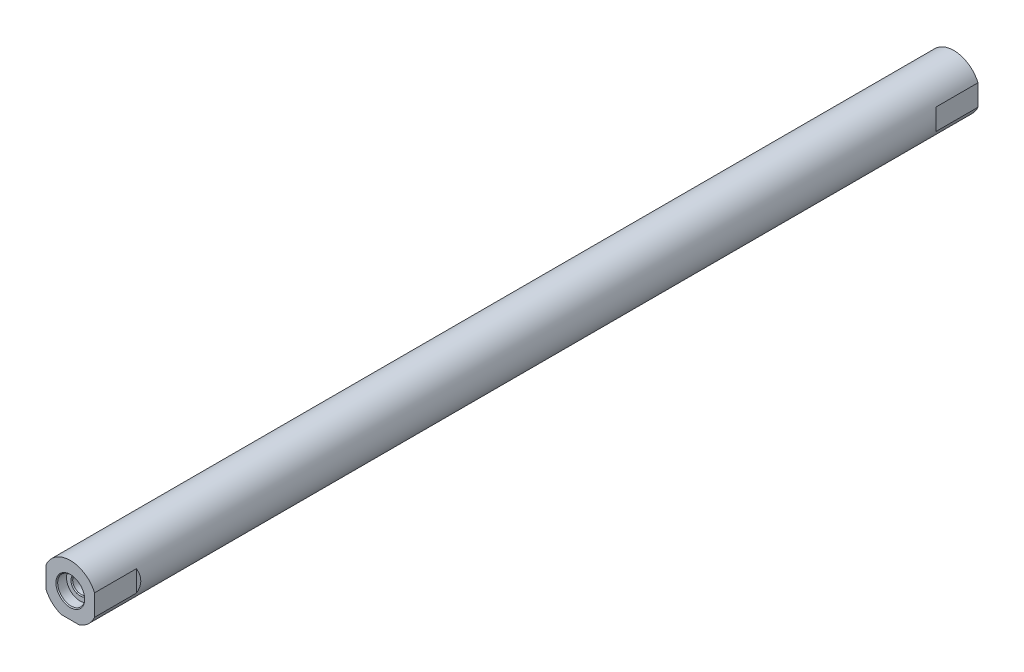
ISO-10303-21;
HEADER;
FILE_DESCRIPTION(('STEP AP214'),'2;1');
FILE_NAME('part.step','',(''),(''),'','','');
FILE_SCHEMA(('AUTOMOTIVE_DESIGN { 1 0 10303 214 1 1 1 1 }'));
ENDSEC;
DATA;
#1=APPLICATION_CONTEXT('core data for automotive mechanical design processes');
#2=APPLICATION_PROTOCOL_DEFINITION('international standard','automotive_design',2000,#1);
#3=PRODUCT_CONTEXT('',#1,'mechanical');
#4=PRODUCT('Part','Part','',(#3));
#5=PRODUCT_RELATED_PRODUCT_CATEGORY('part','',(#4));
#6=PRODUCT_DEFINITION_FORMATION('','',#4);
#7=PRODUCT_DEFINITION_CONTEXT('part definition',#1,'design');
#8=PRODUCT_DEFINITION('design','',#6,#7);
#9=PRODUCT_DEFINITION_SHAPE('','',#8);
#10=(LENGTH_UNIT() NAMED_UNIT(*) SI_UNIT(.MILLI.,.METRE.));
#11=(NAMED_UNIT(*) PLANE_ANGLE_UNIT() SI_UNIT($,.RADIAN.));
#12=(NAMED_UNIT(*) SI_UNIT($,.STERADIAN.) SOLID_ANGLE_UNIT());
#13=UNCERTAINTY_MEASURE_WITH_UNIT(LENGTH_MEASURE(1.E-05),#10,'distance_accuracy_value','');
#14=(GEOMETRIC_REPRESENTATION_CONTEXT(3) GLOBAL_UNCERTAINTY_ASSIGNED_CONTEXT((#13)) GLOBAL_UNIT_ASSIGNED_CONTEXT((#10,
#11,#12)) REPRESENTATION_CONTEXT('',''));
#15=CARTESIAN_POINT('',(0.,0.,0.));
#16=DIRECTION('',(0.,0.,1.));
#17=DIRECTION('',(1.,0.,0.));
#18=AXIS2_PLACEMENT_3D('',#15,#16,#17);
#19=CARTESIAN_POINT('',(0.,0.,100.));
#20=DIRECTION('',(0.,0.,-1.));
#21=DIRECTION('',(-1.,0.,0.));
#22=AXIS2_PLACEMENT_3D('',#19,#20,#21);
#23=CYLINDRICAL_SURFACE('',#22,6.);
#24=DIRECTION('',(0.,0.,-1.));
#25=VECTOR('',#24,1.);
#26=CARTESIAN_POINT('',(-5.5,2.39791576165636,-90.));
#27=LINE('',#26,#25);
#28=CARTESIAN_POINT('',(-5.5,2.39791576165636,-90.54));
#29=VERTEX_POINT('',#28);
#30=CARTESIAN_POINT('',(-5.5,2.39791576165636,-100.));
#31=VERTEX_POINT('',#30);
#32=EDGE_CURVE('E129',#29,#31,#27,.T.);
#33=ORIENTED_EDGE('',*,*,#32,.F.);
#34=CARTESIAN_POINT('',(0.,0.,-96.0400000000001));
#35=DIRECTION('',(-0.707106781186553,0.,-0.707106781186542));
#36=DIRECTION('',(0.707106781186542,0.,-0.707106781186553));
#37=AXIS2_PLACEMENT_3D('',#34,#35,#36);
#38=ELLIPSE('',#37,8.48528137423864,6.);
#39=CARTESIAN_POINT('',(-5.5,-2.39791576165636,-90.54));
#40=VERTEX_POINT('',#39);
#41=EDGE_CURVE('E11',#29,#40,#38,.F.);
#42=ORIENTED_EDGE('',*,*,#41,.T.);
#43=DIRECTION('',(0.,0.,-1.));
#44=VECTOR('',#43,1.);
#45=CARTESIAN_POINT('',(-5.5,-2.39791576165636,-90.));
#46=LINE('',#45,#44);
#47=CARTESIAN_POINT('',(-5.5,-2.39791576165636,-100.));
#48=VERTEX_POINT('',#47);
#49=EDGE_CURVE('E121',#40,#48,#46,.T.);
#50=ORIENTED_EDGE('',*,*,#49,.T.);
#51=CARTESIAN_POINT('',(0.,0.,-100.));
#52=DIRECTION('',(0.,0.,1.));
#53=DIRECTION('',(1.,0.,0.));
#54=AXIS2_PLACEMENT_3D('',#51,#52,#53);
#55=CIRCLE('',#54,6.);
#56=CARTESIAN_POINT('',(-2.04704665310784,-5.64,-100.));
#57=VERTEX_POINT('',#56);
#58=EDGE_CURVE('E125',#48,#57,#55,.T.);
#59=ORIENTED_EDGE('',*,*,#58,.T.);
#60=DIRECTION('',(0.,0.,1.));
#61=VECTOR('',#60,1.);
#62=CARTESIAN_POINT('',(-2.04704665310784,-5.64,-100.));
#63=LINE('',#62,#61);
#64=CARTESIAN_POINT('',(-2.04704665310784,-5.64,100.));
#65=VERTEX_POINT('',#64);
#66=EDGE_CURVE('E304',#57,#65,#63,.T.);
#67=ORIENTED_EDGE('',*,*,#66,.T.);
#68=CARTESIAN_POINT('',(0.,0.,100.));
#69=DIRECTION('',(0.,0.,1.));
#70=DIRECTION('',(1.,0.,0.));
#71=AXIS2_PLACEMENT_3D('',#68,#69,#70);
#72=CIRCLE('',#71,6.);
#73=CARTESIAN_POINT('',(-5.5,-2.39791576165636,100.));
#74=VERTEX_POINT('',#73);
#75=EDGE_CURVE('E153',#74,#65,#72,.T.);
#76=ORIENTED_EDGE('',*,*,#75,.F.);
#77=DIRECTION('',(0.,0.,1.));
#78=VECTOR('',#77,1.);
#79=CARTESIAN_POINT('',(-5.5,-2.39791576165636,90.));
#80=LINE('',#79,#78);
#81=CARTESIAN_POINT('',(-5.5,-2.39791576165636,90.54));
#82=VERTEX_POINT('',#81);
#83=EDGE_CURVE('E287',#82,#74,#80,.T.);
#84=ORIENTED_EDGE('',*,*,#83,.F.);
#85=CARTESIAN_POINT('',(0.,0.,96.0399999999999));
#86=DIRECTION('',(0.707106781186541,0.,-0.707106781186554));
#87=DIRECTION('',(-0.707106781186554,0.,-0.707106781186541));
#88=AXIS2_PLACEMENT_3D('',#85,#86,#87);
#89=ELLIPSE('',#88,8.48528137423849,6.);
#90=CARTESIAN_POINT('',(-5.5,2.39791576165636,90.54));
#91=VERTEX_POINT('',#90);
#92=EDGE_CURVE('E201',#82,#91,#89,.T.);
#93=ORIENTED_EDGE('',*,*,#92,.T.);
#94=DIRECTION('',(0.,0.,1.));
#95=VECTOR('',#94,1.);
#96=CARTESIAN_POINT('',(-5.5,2.39791576165636,90.));
#97=LINE('',#96,#95);
#98=CARTESIAN_POINT('',(-5.5,2.39791576165636,100.));
#99=VERTEX_POINT('',#98);
#100=EDGE_CURVE('E288',#91,#99,#97,.T.);
#101=ORIENTED_EDGE('',*,*,#100,.T.);
#102=CARTESIAN_POINT('',(5.5,2.39791576165636,100.));
#103=VERTEX_POINT('',#102);
#104=EDGE_CURVE('E156',#103,#99,#72,.T.);
#105=ORIENTED_EDGE('',*,*,#104,.F.);
#106=DIRECTION('',(0.,0.,1.));
#107=VECTOR('',#106,1.);
#108=CARTESIAN_POINT('',(5.5,2.39791576165636,90.));
#109=LINE('',#108,#107);
#110=CARTESIAN_POINT('',(5.5,2.39791576165636,90.54));
#111=VERTEX_POINT('',#110);
#112=EDGE_CURVE('E296',#111,#103,#109,.T.);
#113=ORIENTED_EDGE('',*,*,#112,.F.);
#114=CARTESIAN_POINT('',(0.,0.,96.0399999999999));
#115=DIRECTION('',(-0.707106781186541,0.,-0.707106781186554));
#116=DIRECTION('',(0.707106781186554,0.,-0.707106781186541));
#117=AXIS2_PLACEMENT_3D('',#114,#115,#116);
#118=ELLIPSE('',#117,8.48528137423849,6.);
#119=CARTESIAN_POINT('',(5.5,-2.39791576165636,90.54));
#120=VERTEX_POINT('',#119);
#121=EDGE_CURVE('E199',#111,#120,#118,.T.);
#122=ORIENTED_EDGE('',*,*,#121,.T.);
#123=DIRECTION('',(0.,0.,1.));
#124=VECTOR('',#123,1.);
#125=CARTESIAN_POINT('',(5.5,-2.39791576165636,90.));
#126=LINE('',#125,#124);
#127=CARTESIAN_POINT('',(5.5,-2.39791576165636,100.));
#128=VERTEX_POINT('',#127);
#129=EDGE_CURVE('E128',#120,#128,#126,.T.);
#130=ORIENTED_EDGE('',*,*,#129,.T.);
#131=CARTESIAN_POINT('',(2.04704665310784,-5.64,100.));
#132=VERTEX_POINT('',#131);
#133=EDGE_CURVE('E157',#132,#128,#72,.T.);
#134=ORIENTED_EDGE('',*,*,#133,.F.);
#135=DIRECTION('',(0.,0.,1.));
#136=VECTOR('',#135,1.);
#137=CARTESIAN_POINT('',(2.04704665310784,-5.64,-100.));
#138=LINE('',#137,#136);
#139=CARTESIAN_POINT('',(2.04704665310784,-5.64,-100.));
#140=VERTEX_POINT('',#139);
#141=EDGE_CURVE('E302',#140,#132,#138,.T.);
#142=ORIENTED_EDGE('',*,*,#141,.F.);
#143=CARTESIAN_POINT('',(5.5,-2.39791576165636,-100.));
#144=VERTEX_POINT('',#143);
#145=EDGE_CURVE('E146',#140,#144,#55,.T.);
#146=ORIENTED_EDGE('',*,*,#145,.T.);
#147=DIRECTION('',(0.,0.,-1.));
#148=VECTOR('',#147,1.);
#149=CARTESIAN_POINT('',(5.5,-2.39791576165636,-90.));
#150=LINE('',#149,#148);
#151=CARTESIAN_POINT('',(5.5,-2.39791576165636,-90.54));
#152=VERTEX_POINT('',#151);
#153=EDGE_CURVE('E209',#152,#144,#150,.T.);
#154=ORIENTED_EDGE('',*,*,#153,.F.);
#155=CARTESIAN_POINT('',(0.,0.,-96.0400000000001));
#156=DIRECTION('',(0.707106781186553,0.,-0.707106781186542));
#157=DIRECTION('',(-0.707106781186542,0.,-0.707106781186553));
#158=AXIS2_PLACEMENT_3D('',#155,#156,#157);
#159=ELLIPSE('',#158,8.48528137423864,6.);
#160=CARTESIAN_POINT('',(5.5,2.39791576165636,-90.54));
#161=VERTEX_POINT('',#160);
#162=EDGE_CURVE('E52',#152,#161,#159,.F.);
#163=ORIENTED_EDGE('',*,*,#162,.T.);
#164=DIRECTION('',(0.,0.,-1.));
#165=VECTOR('',#164,1.);
#166=CARTESIAN_POINT('',(5.5,2.39791576165636,-90.));
#167=LINE('',#166,#165);
#168=CARTESIAN_POINT('',(5.5,2.39791576165636,-100.));
#169=VERTEX_POINT('',#168);
#170=EDGE_CURVE('E137',#161,#169,#167,.T.);
#171=ORIENTED_EDGE('',*,*,#170,.T.);
#172=EDGE_CURVE('E143',#169,#31,#55,.T.);
#173=ORIENTED_EDGE('',*,*,#172,.T.);
#174=EDGE_LOOP('',(#33,#42,#50,#59,#67,#76,#84,#93,#101,#105,#113,#122,#130,#134,#142,#146,#154,
#163,#171,#173));
#175=FACE_BOUND('',#174,.T.);
#176=ADVANCED_FACE('F43',(#175),#23,.T.);
#177=CARTESIAN_POINT('',(0.,0.,-100.));
#178=DIRECTION('',(0.,0.,1.));
#179=DIRECTION('',(1.,0.,0.));
#180=AXIS2_PLACEMENT_3D('',#177,#178,#179);
#181=PLANE('',#180);
#182=CARTESIAN_POINT('',(0.,0.,-100.));
#183=DIRECTION('',(0.,0.,1.));
#184=DIRECTION('',(1.,0.,0.));
#185=AXIS2_PLACEMENT_3D('',#182,#183,#184);
#186=CIRCLE('',#185,3.25);
#187=CARTESIAN_POINT('',(3.25,0.,-100.));
#188=VERTEX_POINT('',#187);
#189=EDGE_CURVE('E165',#188,#188,#186,.T.);
#190=ORIENTED_EDGE('',*,*,#189,.T.);
#191=EDGE_LOOP('',(#190));
#192=FACE_BOUND('',#191,.T.);
#193=DIRECTION('',(0.,1.,0.));
#194=VECTOR('',#193,1.);
#195=CARTESIAN_POINT('',(-5.5,-2.39791576165636,-100.));
#196=LINE('',#195,#194);
#197=EDGE_CURVE('E132',#48,#31,#196,.T.);
#198=ORIENTED_EDGE('',*,*,#197,.T.);
#199=ORIENTED_EDGE('',*,*,#172,.F.);
#200=DIRECTION('',(0.,-1.,0.));
#201=VECTOR('',#200,1.);
#202=CARTESIAN_POINT('',(5.5,-2.39791576165636,-100.));
#203=LINE('',#202,#201);
#204=EDGE_CURVE('E215',#169,#144,#203,.T.);
#205=ORIENTED_EDGE('',*,*,#204,.T.);
#206=ORIENTED_EDGE('',*,*,#145,.F.);
#207=DIRECTION('',(-1.,0.,0.));
#208=VECTOR('',#207,1.);
#209=CARTESIAN_POINT('',(2.04704665310784,-5.64,-100.));
#210=LINE('',#209,#208);
#211=EDGE_CURVE('E142',#140,#57,#210,.T.);
#212=ORIENTED_EDGE('',*,*,#211,.T.);
#213=ORIENTED_EDGE('',*,*,#58,.F.);
#214=EDGE_LOOP('',(#198,#199,#205,#206,#212,#213));
#215=FACE_BOUND('',#214,.T.);
#216=ADVANCED_FACE('F140',(#192,#215),#181,.F.);
#217=CARTESIAN_POINT('',(0.,0.,100.));
#218=DIRECTION('',(0.,0.,1.));
#219=DIRECTION('',(1.,0.,0.));
#220=AXIS2_PLACEMENT_3D('',#217,#218,#219);
#221=PLANE('',#220);
#222=DIRECTION('',(0.,1.,0.));
#223=VECTOR('',#222,1.);
#224=CARTESIAN_POINT('',(-5.5,-2.39791576165636,100.));
#225=LINE('',#224,#223);
#226=EDGE_CURVE('E289',#74,#99,#225,.T.);
#227=ORIENTED_EDGE('',*,*,#226,.F.);
#228=ORIENTED_EDGE('',*,*,#75,.T.);
#229=DIRECTION('',(-1.,0.,0.));
#230=VECTOR('',#229,1.);
#231=CARTESIAN_POINT('',(2.04704665310784,-5.64,100.));
#232=LINE('',#231,#230);
#233=EDGE_CURVE('E291',#132,#65,#232,.T.);
#234=ORIENTED_EDGE('',*,*,#233,.F.);
#235=ORIENTED_EDGE('',*,*,#133,.T.);
#236=DIRECTION('',(0.,-1.,0.));
#237=VECTOR('',#236,1.);
#238=CARTESIAN_POINT('',(5.5,-2.39791576165636,100.));
#239=LINE('',#238,#237);
#240=EDGE_CURVE('E293',#103,#128,#239,.T.);
#241=ORIENTED_EDGE('',*,*,#240,.F.);
#242=ORIENTED_EDGE('',*,*,#104,.T.);
#243=EDGE_LOOP('',(#227,#228,#234,#235,#241,#242));
#244=FACE_BOUND('',#243,.T.);
#245=CARTESIAN_POINT('',(0.,0.,100.));
#246=DIRECTION('',(0.,0.,1.));
#247=DIRECTION('',(1.,0.,0.));
#248=AXIS2_PLACEMENT_3D('',#245,#246,#247);
#249=CIRCLE('',#248,3.25000000000003);
#250=CARTESIAN_POINT('',(3.25000000000003,0.,100.));
#251=VERTEX_POINT('',#250);
#252=EDGE_CURVE('E190',#251,#251,#249,.F.);
#253=ORIENTED_EDGE('',*,*,#252,.T.);
#254=EDGE_LOOP('',(#253));
#255=FACE_BOUND('',#254,.T.);
#256=ADVANCED_FACE('F232',(#244,#255),#221,.T.);
#257=CARTESIAN_POINT('',(0.,0.,97.8));
#258=DIRECTION('',(0.,0.,1.));
#259=DIRECTION('',(1.,0.,0.));
#260=AXIS2_PLACEMENT_3D('',#257,#258,#259);
#261=PLANE('',#260);
#262=CARTESIAN_POINT('',(0.,0.,97.8));
#263=DIRECTION('',(0.,0.,1.));
#264=DIRECTION('',(1.,0.,0.));
#265=AXIS2_PLACEMENT_3D('',#262,#263,#264);
#266=CIRCLE('',#265,2.05);
#267=CARTESIAN_POINT('',(2.05,0.,97.8));
#268=VERTEX_POINT('',#267);
#269=EDGE_CURVE('E181',#268,#268,#266,.F.);
#270=ORIENTED_EDGE('',*,*,#269,.T.);
#271=EDGE_LOOP('',(#270));
#272=FACE_BOUND('',#271,.T.);
#273=CARTESIAN_POINT('',(0.,0.,97.8));
#274=DIRECTION('',(0.,0.,1.));
#275=DIRECTION('',(1.,0.,0.));
#276=AXIS2_PLACEMENT_3D('',#273,#274,#275);
#277=CIRCLE('',#276,3.05);
#278=CARTESIAN_POINT('',(3.05,0.,97.8));
#279=VERTEX_POINT('',#278);
#280=EDGE_CURVE('E148',#279,#279,#277,.T.);
#281=ORIENTED_EDGE('',*,*,#280,.T.);
#282=EDGE_LOOP('',(#281));
#283=FACE_BOUND('',#282,.T.);
#284=ADVANCED_FACE('F316',(#272,#283),#261,.T.);
#285=CARTESIAN_POINT('',(0.,0.,97.8));
#286=DIRECTION('',(0.,0.,1.));
#287=DIRECTION('',(1.,0.,0.));
#288=AXIS2_PLACEMENT_3D('',#285,#286,#287);
#289=CYLINDRICAL_SURFACE('',#288,3.05);
#290=CARTESIAN_POINT('',(0.,0.,99.8));
#291=DIRECTION('',(0.,0.,1.));
#292=DIRECTION('',(1.,0.,0.));
#293=AXIS2_PLACEMENT_3D('',#290,#291,#292);
#294=CIRCLE('',#293,3.05);
#295=CARTESIAN_POINT('',(3.05,0.,99.8));
#296=VERTEX_POINT('',#295);
#297=EDGE_CURVE('E187',#296,#296,#294,.T.);
#298=ORIENTED_EDGE('',*,*,#297,.T.);
#299=EDGE_LOOP('',(#298));
#300=FACE_BOUND('',#299,.T.);
#301=ORIENTED_EDGE('',*,*,#280,.F.);
#302=EDGE_LOOP('',(#301));
#303=FACE_BOUND('',#302,.T.);
#304=ADVANCED_FACE('F318',(#300,#303),#289,.F.);
#305=CARTESIAN_POINT('',(0.,0.,88.));
#306=DIRECTION('',(0.,0.,1.));
#307=DIRECTION('',(1.,0.,0.));
#308=AXIS2_PLACEMENT_3D('',#305,#306,#307);
#309=CONICAL_SURFACE('',#308,1.85,0.785398163397451);
#310=CARTESIAN_POINT('',(0.,0.,86.15));
#311=VERTEX_POINT('',#310);
#312=VERTEX_LOOP('',#311);
#313=FACE_BOUND('',#312,.T.);
#314=CARTESIAN_POINT('',(0.,0.,88.));
#315=DIRECTION('',(0.,0.,1.));
#316=DIRECTION('',(1.,0.,0.));
#317=AXIS2_PLACEMENT_3D('',#314,#315,#316);
#318=CIRCLE('',#317,1.85);
#319=CARTESIAN_POINT('',(1.85,0.,88.));
#320=VERTEX_POINT('',#319);
#321=EDGE_CURVE('E144',#320,#320,#318,.T.);
#322=ORIENTED_EDGE('',*,*,#321,.T.);
#323=EDGE_LOOP('',(#322));
#324=FACE_BOUND('',#323,.T.);
#325=ADVANCED_FACE('F320',(#313,#324),#309,.F.);
#326=CARTESIAN_POINT('',(0.,0.,100.));
#327=DIRECTION('',(0.,0.,1.));
#328=DIRECTION('',(1.,0.,0.));
#329=AXIS2_PLACEMENT_3D('',#326,#327,#328);
#330=CYLINDRICAL_SURFACE('',#329,1.85);
#331=CARTESIAN_POINT('',(0.,0.,97.6));
#332=DIRECTION('',(0.,0.,1.));
#333=DIRECTION('',(1.,0.,0.));
#334=AXIS2_PLACEMENT_3D('',#331,#332,#333);
#335=CIRCLE('',#334,1.85);
#336=CARTESIAN_POINT('',(1.85,0.,97.6));
#337=VERTEX_POINT('',#336);
#338=EDGE_CURVE('E184',#337,#337,#335,.T.);
#339=ORIENTED_EDGE('',*,*,#338,.T.);
#340=EDGE_LOOP('',(#339));
#341=FACE_BOUND('',#340,.T.);
#342=ORIENTED_EDGE('',*,*,#321,.F.);
#343=EDGE_LOOP('',(#342));
#344=FACE_BOUND('',#343,.T.);
#345=ADVANCED_FACE('F328',(#341,#344),#330,.F.);
#346=CARTESIAN_POINT('',(0.,0.,-97.8));
#347=DIRECTION('',(0.,0.,-1.));
#348=DIRECTION('',(1.,0.,0.));
#349=AXIS2_PLACEMENT_3D('',#346,#347,#348);
#350=PLANE('',#349);
#351=CARTESIAN_POINT('',(0.,0.,-97.8));
#352=DIRECTION('',(0.,0.,-1.));
#353=DIRECTION('',(-1.,0.,0.));
#354=AXIS2_PLACEMENT_3D('',#351,#352,#353);
#355=CIRCLE('',#354,2.05);
#356=CARTESIAN_POINT('',(-2.05,0.,-97.8));
#357=VERTEX_POINT('',#356);
#358=EDGE_CURVE('E173',#357,#357,#355,.F.);
#359=ORIENTED_EDGE('',*,*,#358,.T.);
#360=EDGE_LOOP('',(#359));
#361=FACE_BOUND('',#360,.T.);
#362=CARTESIAN_POINT('',(0.,0.,-97.8));
#363=DIRECTION('',(0.,0.,1.));
#364=DIRECTION('',(1.,0.,0.));
#365=AXIS2_PLACEMENT_3D('',#362,#363,#364);
#366=CIRCLE('',#365,3.05);
#367=CARTESIAN_POINT('',(3.05,0.,-97.8));
#368=VERTEX_POINT('',#367);
#369=EDGE_CURVE('E306',#368,#368,#366,.T.);
#370=ORIENTED_EDGE('',*,*,#369,.F.);
#371=EDGE_LOOP('',(#370));
#372=FACE_BOUND('',#371,.T.);
#373=ADVANCED_FACE('F335',(#361,#372),#350,.T.);
#374=CARTESIAN_POINT('',(0.,0.,-97.8));
#375=DIRECTION('',(0.,0.,-1.));
#376=DIRECTION('',(-1.,0.,0.));
#377=AXIS2_PLACEMENT_3D('',#374,#375,#376);
#378=CYLINDRICAL_SURFACE('',#377,3.05);
#379=CARTESIAN_POINT('',(0.,0.,-99.8));
#380=DIRECTION('',(0.,0.,1.));
#381=DIRECTION('',(1.,0.,0.));
#382=AXIS2_PLACEMENT_3D('',#379,#380,#381);
#383=CIRCLE('',#382,3.05);
#384=CARTESIAN_POINT('',(3.05,0.,-99.8));
#385=VERTEX_POINT('',#384);
#386=EDGE_CURVE('E169',#385,#385,#383,.F.);
#387=ORIENTED_EDGE('',*,*,#386,.T.);
#388=EDGE_LOOP('',(#387));
#389=FACE_BOUND('',#388,.T.);
#390=ORIENTED_EDGE('',*,*,#369,.T.);
#391=EDGE_LOOP('',(#390));
#392=FACE_BOUND('',#391,.T.);
#393=ADVANCED_FACE('F364',(#389,#392),#378,.F.);
#394=CARTESIAN_POINT('',(0.,0.,-88.));
#395=DIRECTION('',(0.,0.,-1.));
#396=DIRECTION('',(-1.,0.,0.));
#397=AXIS2_PLACEMENT_3D('',#394,#395,#396);
#398=CONICAL_SURFACE('',#397,1.85,0.785398163397451);
#399=CARTESIAN_POINT('',(0.,0.,-86.15));
#400=VERTEX_POINT('',#399);
#401=VERTEX_LOOP('',#400);
#402=FACE_BOUND('',#401,.T.);
#403=CARTESIAN_POINT('',(0.,0.,-88.));
#404=DIRECTION('',(0.,0.,-1.));
#405=DIRECTION('',(-1.,0.,0.));
#406=AXIS2_PLACEMENT_3D('',#403,#404,#405);
#407=CIRCLE('',#406,1.85);
#408=CARTESIAN_POINT('',(-1.85,0.,-88.));
#409=VERTEX_POINT('',#408);
#410=EDGE_CURVE('E310',#409,#409,#407,.T.);
#411=ORIENTED_EDGE('',*,*,#410,.T.);
#412=EDGE_LOOP('',(#411));
#413=FACE_BOUND('',#412,.T.);
#414=ADVANCED_FACE('F368',(#402,#413),#398,.F.);
#415=CARTESIAN_POINT('',(0.,0.,-100.));
#416=DIRECTION('',(0.,0.,-1.));
#417=DIRECTION('',(-1.,0.,0.));
#418=AXIS2_PLACEMENT_3D('',#415,#416,#417);
#419=CYLINDRICAL_SURFACE('',#418,1.85);
#420=CARTESIAN_POINT('',(0.,0.,-97.6));
#421=DIRECTION('',(0.,0.,-1.));
#422=DIRECTION('',(-1.,0.,0.));
#423=AXIS2_PLACEMENT_3D('',#420,#421,#422);
#424=CIRCLE('',#423,1.85);
#425=CARTESIAN_POINT('',(-1.85,0.,-97.6));
#426=VERTEX_POINT('',#425);
#427=EDGE_CURVE('E178',#426,#426,#424,.T.);
#428=ORIENTED_EDGE('',*,*,#427,.T.);
#429=EDGE_LOOP('',(#428));
#430=FACE_BOUND('',#429,.T.);
#431=ORIENTED_EDGE('',*,*,#410,.F.);
#432=EDGE_LOOP('',(#431));
#433=FACE_BOUND('',#432,.T.);
#434=ADVANCED_FACE('F244',(#430,#433),#419,.F.);
#435=CARTESIAN_POINT('',(0.,0.,-100.));
#436=DIRECTION('',(0.,0.,-1.));
#437=DIRECTION('',(-1.,0.,0.));
#438=AXIS2_PLACEMENT_3D('',#435,#436,#437);
#439=CONICAL_SURFACE('',#438,3.25,0.785398163397407);
#440=ORIENTED_EDGE('',*,*,#386,.F.);
#441=EDGE_LOOP('',(#440));
#442=FACE_BOUND('',#441,.T.);
#443=ORIENTED_EDGE('',*,*,#189,.F.);
#444=EDGE_LOOP('',(#443));
#445=FACE_BOUND('',#444,.T.);
#446=ADVANCED_FACE('F237',(#442,#445),#439,.F.);
#447=CARTESIAN_POINT('',(0.,0.,-97.8));
#448=DIRECTION('',(0.,0.,-1.));
#449=DIRECTION('',(-1.,0.,0.));
#450=AXIS2_PLACEMENT_3D('',#447,#448,#449);
#451=CONICAL_SURFACE('',#450,2.05,0.785398163397459);
#452=ORIENTED_EDGE('',*,*,#427,.F.);
#453=EDGE_LOOP('',(#452));
#454=FACE_BOUND('',#453,.T.);
#455=ORIENTED_EDGE('',*,*,#358,.F.);
#456=EDGE_LOOP('',(#455));
#457=FACE_BOUND('',#456,.T.);
#458=ADVANCED_FACE('F243',(#454,#457),#451,.F.);
#459=CARTESIAN_POINT('',(0.,0.,97.8));
#460=DIRECTION('',(0.,0.,1.));
#461=DIRECTION('',(1.,0.,0.));
#462=AXIS2_PLACEMENT_3D('',#459,#460,#461);
#463=CONICAL_SURFACE('',#462,2.05,0.785398163397459);
#464=ORIENTED_EDGE('',*,*,#338,.F.);
#465=EDGE_LOOP('',(#464));
#466=FACE_BOUND('',#465,.T.);
#467=ORIENTED_EDGE('',*,*,#269,.F.);
#468=EDGE_LOOP('',(#467));
#469=FACE_BOUND('',#468,.T.);
#470=ADVANCED_FACE('F251',(#466,#469),#463,.F.);
#471=CARTESIAN_POINT('',(0.,0.,99.8));
#472=DIRECTION('',(0.,0.,1.));
#473=DIRECTION('',(1.,0.,0.));
#474=AXIS2_PLACEMENT_3D('',#471,#472,#473);
#475=CONICAL_SURFACE('',#474,3.05,0.785398163397407);
#476=ORIENTED_EDGE('',*,*,#252,.F.);
#477=EDGE_LOOP('',(#476));
#478=FACE_BOUND('',#477,.T.);
#479=ORIENTED_EDGE('',*,*,#297,.F.);
#480=EDGE_LOOP('',(#479));
#481=FACE_BOUND('',#480,.T.);
#482=ADVANCED_FACE('F258',(#478,#481),#475,.F.);
#483=CARTESIAN_POINT('',(2.04704665310784,-5.64,-100.));
#484=DIRECTION('',(0.,1.,0.));
#485=DIRECTION('',(0.,0.,1.));
#486=AXIS2_PLACEMENT_3D('',#483,#484,#485);
#487=PLANE('',#486);
#488=ORIENTED_EDGE('',*,*,#233,.T.);
#489=ORIENTED_EDGE('',*,*,#66,.F.);
#490=ORIENTED_EDGE('',*,*,#211,.F.);
#491=ORIENTED_EDGE('',*,*,#141,.T.);
#492=EDGE_LOOP('',(#488,#489,#490,#491));
#493=FACE_BOUND('',#492,.T.);
#494=ADVANCED_FACE('F265',(#493),#487,.F.);
#495=CARTESIAN_POINT('',(5.5,-2.39791576165636,90.));
#496=DIRECTION('',(-1.,0.,0.));
#497=DIRECTION('',(0.,0.,1.));
#498=AXIS2_PLACEMENT_3D('',#495,#496,#497);
#499=PLANE('',#498);
#500=ORIENTED_EDGE('',*,*,#129,.F.);
#501=DIRECTION('',(0.,1.,0.));
#502=VECTOR('',#501,1.);
#503=CARTESIAN_POINT('',(5.5,-2.39791576165636,90.54));
#504=LINE('',#503,#502);
#505=EDGE_CURVE('E193',#120,#111,#504,.T.);
#506=ORIENTED_EDGE('',*,*,#505,.T.);
#507=ORIENTED_EDGE('',*,*,#112,.T.);
#508=ORIENTED_EDGE('',*,*,#240,.T.);
#509=EDGE_LOOP('',(#500,#506,#507,#508));
#510=FACE_BOUND('',#509,.T.);
#511=ADVANCED_FACE('F350',(#510),#499,.F.);
#512=CARTESIAN_POINT('',(-5.5,-2.39791576165636,90.));
#513=DIRECTION('',(1.,0.,0.));
#514=DIRECTION('',(0.,0.,-1.));
#515=AXIS2_PLACEMENT_3D('',#512,#513,#514);
#516=PLANE('',#515);
#517=ORIENTED_EDGE('',*,*,#100,.F.);
#518=DIRECTION('',(0.,-1.,0.));
#519=VECTOR('',#518,1.);
#520=CARTESIAN_POINT('',(-5.5,-2.39791576165636,90.54));
#521=LINE('',#520,#519);
#522=EDGE_CURVE('E196',#91,#82,#521,.T.);
#523=ORIENTED_EDGE('',*,*,#522,.T.);
#524=ORIENTED_EDGE('',*,*,#83,.T.);
#525=ORIENTED_EDGE('',*,*,#226,.T.);
#526=EDGE_LOOP('',(#517,#523,#524,#525));
#527=FACE_BOUND('',#526,.T.);
#528=ADVANCED_FACE('F273',(#527),#516,.F.);
#529=CARTESIAN_POINT('',(6.04000000000001,0.,90.));
#530=DIRECTION('',(-0.707106781186541,0.,-0.707106781186554));
#531=DIRECTION('',(0.,-1.,0.));
#532=AXIS2_PLACEMENT_3D('',#529,#530,#531);
#533=PLANE('',#532);
#534=ORIENTED_EDGE('',*,*,#121,.F.);
#535=ORIENTED_EDGE('',*,*,#505,.F.);
#536=EDGE_LOOP('',(#534,#535));
#537=FACE_BOUND('',#536,.T.);
#538=ADVANCED_FACE('F267',(#537),#533,.F.);
#539=CARTESIAN_POINT('',(-6.04000000000001,0.,90.));
#540=DIRECTION('',(0.707106781186541,0.,-0.707106781186554));
#541=DIRECTION('',(0.,1.,0.));
#542=AXIS2_PLACEMENT_3D('',#539,#540,#541);
#543=PLANE('',#542);
#544=ORIENTED_EDGE('',*,*,#92,.F.);
#545=ORIENTED_EDGE('',*,*,#522,.F.);
#546=EDGE_LOOP('',(#544,#545));
#547=FACE_BOUND('',#546,.T.);
#548=ADVANCED_FACE('F272',(#547),#543,.F.);
#549=CARTESIAN_POINT('',(5.5,-2.39791576165636,-90.));
#550=DIRECTION('',(1.,0.,0.));
#551=DIRECTION('',(0.,0.,-1.));
#552=AXIS2_PLACEMENT_3D('',#549,#550,#551);
#553=PLANE('',#552);
#554=ORIENTED_EDGE('',*,*,#170,.F.);
#555=DIRECTION('',(0.,-1.,0.));
#556=VECTOR('',#555,1.);
#557=CARTESIAN_POINT('',(5.5,-2.39791576165636,-90.54));
#558=LINE('',#557,#556);
#559=EDGE_CURVE('E203',#161,#152,#558,.T.);
#560=ORIENTED_EDGE('',*,*,#559,.T.);
#561=ORIENTED_EDGE('',*,*,#153,.T.);
#562=ORIENTED_EDGE('',*,*,#204,.F.);
#563=EDGE_LOOP('',(#554,#560,#561,#562));
#564=FACE_BOUND('',#563,.T.);
#565=ADVANCED_FACE('F213',(#564),#553,.T.);
#566=CARTESIAN_POINT('',(-5.5,-2.39791576165636,-90.));
#567=DIRECTION('',(-1.,0.,0.));
#568=DIRECTION('',(0.,0.,1.));
#569=AXIS2_PLACEMENT_3D('',#566,#567,#568);
#570=PLANE('',#569);
#571=ORIENTED_EDGE('',*,*,#49,.F.);
#572=DIRECTION('',(0.,1.,0.));
#573=VECTOR('',#572,1.);
#574=CARTESIAN_POINT('',(-5.5,2.39791576165636,-90.54));
#575=LINE('',#574,#573);
#576=EDGE_CURVE('E206',#40,#29,#575,.T.);
#577=ORIENTED_EDGE('',*,*,#576,.T.);
#578=ORIENTED_EDGE('',*,*,#32,.T.);
#579=ORIENTED_EDGE('',*,*,#197,.F.);
#580=EDGE_LOOP('',(#571,#577,#578,#579));
#581=FACE_BOUND('',#580,.T.);
#582=ADVANCED_FACE('F133',(#581),#570,.T.);
#583=CARTESIAN_POINT('',(5.5,-2.39791576165636,-90.54));
#584=DIRECTION('',(0.707106781186553,0.,-0.707106781186542));
#585=DIRECTION('',(0.,1.,0.));
#586=AXIS2_PLACEMENT_3D('',#583,#584,#585);
#587=PLANE('',#586);
#588=ORIENTED_EDGE('',*,*,#559,.F.);
#589=ORIENTED_EDGE('',*,*,#162,.F.);
#590=EDGE_LOOP('',(#588,#589));
#591=FACE_BOUND('',#590,.T.);
#592=ADVANCED_FACE('F217',(#591),#587,.T.);
#593=CARTESIAN_POINT('',(-5.5,-2.39791576165636,-90.54));
#594=DIRECTION('',(-0.707106781186553,0.,-0.707106781186542));
#595=DIRECTION('',(0.,-1.,0.));
#596=AXIS2_PLACEMENT_3D('',#593,#594,#595);
#597=PLANE('',#596);
#598=ORIENTED_EDGE('',*,*,#576,.F.);
#599=ORIENTED_EDGE('',*,*,#41,.F.);
#600=EDGE_LOOP('',(#598,#599));
#601=FACE_BOUND('',#600,.T.);
#602=ADVANCED_FACE('F46',(#601),#597,.T.);
#603=CLOSED_SHELL('',(#176,#216,#256,#284,#304,#325,#345,#373,#393,#414,#434,#446,#458,#470,
#482,#494,#511,#528,#538,#548,#565,#582,#592,#602));
#604=MANIFOLD_SOLID_BREP('B2',#603);
#605=ADVANCED_BREP_SHAPE_REPRESENTATION('',(#18,#604),#14);
#606=SHAPE_DEFINITION_REPRESENTATION(#9,#605);
ENDSEC;
END-ISO-10303-21;
